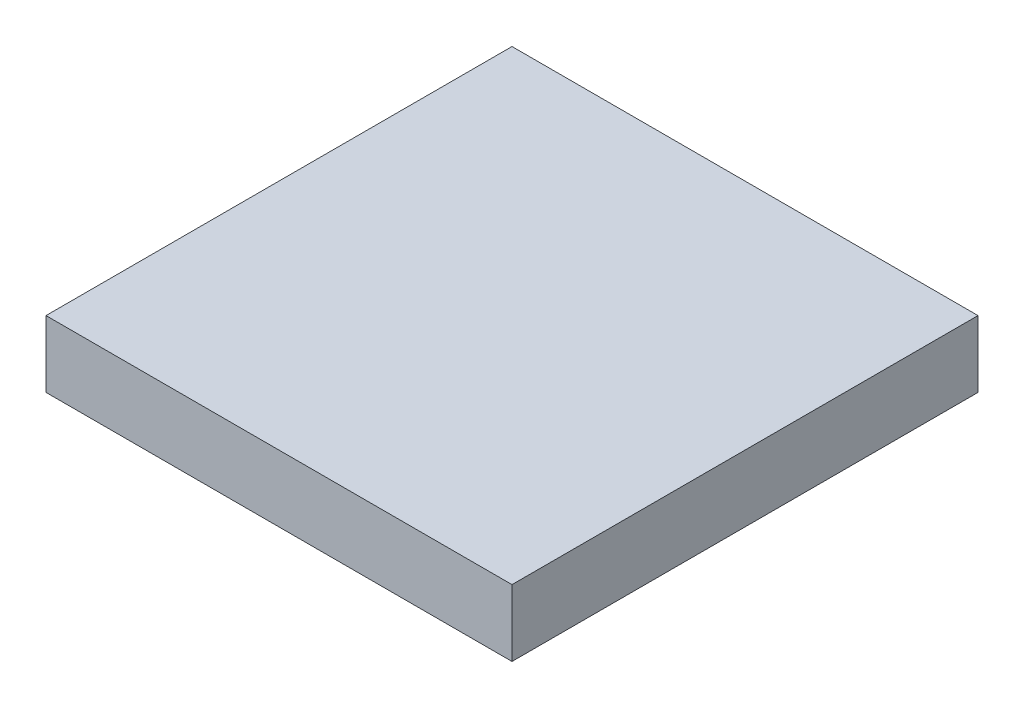
ISO-10303-21;
HEADER;
FILE_DESCRIPTION(('STEP AP214'),'2;1');
FILE_NAME('part.step','',(''),(''),'','','');
FILE_SCHEMA(('AUTOMOTIVE_DESIGN { 1 0 10303 214 1 1 1 1 }'));
ENDSEC;
DATA;
#1=APPLICATION_CONTEXT('core data for automotive mechanical design processes');
#2=APPLICATION_PROTOCOL_DEFINITION('international standard','automotive_design',2000,#1);
#3=PRODUCT_CONTEXT('',#1,'mechanical');
#4=PRODUCT('Part','Part','',(#3));
#5=PRODUCT_RELATED_PRODUCT_CATEGORY('part','',(#4));
#6=PRODUCT_DEFINITION_FORMATION('','',#4);
#7=PRODUCT_DEFINITION_CONTEXT('part definition',#1,'design');
#8=PRODUCT_DEFINITION('design','',#6,#7);
#9=PRODUCT_DEFINITION_SHAPE('','',#8);
#10=(LENGTH_UNIT() NAMED_UNIT(*) SI_UNIT(.MILLI.,.METRE.));
#11=(NAMED_UNIT(*) PLANE_ANGLE_UNIT() SI_UNIT($,.RADIAN.));
#12=(NAMED_UNIT(*) SI_UNIT($,.STERADIAN.) SOLID_ANGLE_UNIT());
#13=UNCERTAINTY_MEASURE_WITH_UNIT(LENGTH_MEASURE(1.E-05),#10,'distance_accuracy_value','');
#14=(GEOMETRIC_REPRESENTATION_CONTEXT(3) GLOBAL_UNCERTAINTY_ASSIGNED_CONTEXT((#13)) GLOBAL_UNIT_ASSIGNED_CONTEXT((#10,
#11,#12)) REPRESENTATION_CONTEXT('',''));
#15=CARTESIAN_POINT('',(0.,0.,0.));
#16=DIRECTION('',(0.,0.,1.));
#17=DIRECTION('',(1.,0.,0.));
#18=AXIS2_PLACEMENT_3D('',#15,#16,#17);
#19=CARTESIAN_POINT('',(-35.,10.,-35.));
#20=DIRECTION('',(1.,0.,0.));
#21=DIRECTION('',(0.,0.,-1.));
#22=AXIS2_PLACEMENT_3D('',#19,#20,#21);
#23=PLANE('',#22);
#24=DIRECTION('',(0.,0.,1.));
#25=VECTOR('',#24,1.);
#26=CARTESIAN_POINT('',(-35.,0.,-35.));
#27=LINE('',#26,#25);
#28=CARTESIAN_POINT('',(-35.,0.,-35.));
#29=VERTEX_POINT('',#28);
#30=CARTESIAN_POINT('',(-35.,0.,35.));
#31=VERTEX_POINT('',#30);
#32=EDGE_CURVE('E97',#29,#31,#27,.T.);
#33=ORIENTED_EDGE('',*,*,#32,.T.);
#34=DIRECTION('',(0.,-1.,0.));
#35=VECTOR('',#34,1.);
#36=CARTESIAN_POINT('',(-35.,10.,35.));
#37=LINE('',#36,#35);
#38=CARTESIAN_POINT('',(-35.,10.,35.));
#39=VERTEX_POINT('',#38);
#40=EDGE_CURVE('E11',#39,#31,#37,.T.);
#41=ORIENTED_EDGE('',*,*,#40,.F.);
#42=DIRECTION('',(0.,0.,1.));
#43=VECTOR('',#42,1.);
#44=CARTESIAN_POINT('',(-35.,10.,-35.));
#45=LINE('',#44,#43);
#46=CARTESIAN_POINT('',(-35.,10.,-35.));
#47=VERTEX_POINT('',#46);
#48=EDGE_CURVE('E85',#47,#39,#45,.T.);
#49=ORIENTED_EDGE('',*,*,#48,.F.);
#50=DIRECTION('',(0.,-1.,0.));
#51=VECTOR('',#50,1.);
#52=CARTESIAN_POINT('',(-35.,10.,-35.));
#53=LINE('',#52,#51);
#54=EDGE_CURVE('E93',#47,#29,#53,.T.);
#55=ORIENTED_EDGE('',*,*,#54,.T.);
#56=EDGE_LOOP('',(#33,#41,#49,#55));
#57=FACE_BOUND('',#56,.T.);
#58=ADVANCED_FACE('F34',(#57),#23,.F.);
#59=CARTESIAN_POINT('',(-35.,10.,35.));
#60=DIRECTION('',(0.,0.,-1.));
#61=DIRECTION('',(-1.,0.,0.));
#62=AXIS2_PLACEMENT_3D('',#59,#60,#61);
#63=PLANE('',#62);
#64=DIRECTION('',(1.,0.,0.));
#65=VECTOR('',#64,1.);
#66=CARTESIAN_POINT('',(-35.,0.,35.));
#67=LINE('',#66,#65);
#68=CARTESIAN_POINT('',(35.,0.,35.));
#69=VERTEX_POINT('',#68);
#70=EDGE_CURVE('E89',#31,#69,#67,.T.);
#71=ORIENTED_EDGE('',*,*,#70,.T.);
#72=DIRECTION('',(0.,-1.,0.));
#73=VECTOR('',#72,1.);
#74=CARTESIAN_POINT('',(35.,10.,35.));
#75=LINE('',#74,#73);
#76=CARTESIAN_POINT('',(35.,10.,35.));
#77=VERTEX_POINT('',#76);
#78=EDGE_CURVE('E42',#77,#69,#75,.T.);
#79=ORIENTED_EDGE('',*,*,#78,.F.);
#80=DIRECTION('',(1.,0.,0.));
#81=VECTOR('',#80,1.);
#82=CARTESIAN_POINT('',(-35.,10.,35.));
#83=LINE('',#82,#81);
#84=EDGE_CURVE('E80',#39,#77,#83,.T.);
#85=ORIENTED_EDGE('',*,*,#84,.F.);
#86=ORIENTED_EDGE('',*,*,#40,.T.);
#87=EDGE_LOOP('',(#71,#79,#85,#86));
#88=FACE_BOUND('',#87,.T.);
#89=ADVANCED_FACE('F88',(#88),#63,.F.);
#90=CARTESIAN_POINT('',(35.,10.,-35.));
#91=DIRECTION('',(-1.,0.,0.));
#92=DIRECTION('',(0.,0.,1.));
#93=AXIS2_PLACEMENT_3D('',#90,#91,#92);
#94=PLANE('',#93);
#95=DIRECTION('',(0.,0.,-1.));
#96=VECTOR('',#95,1.);
#97=CARTESIAN_POINT('',(35.,0.,-35.));
#98=LINE('',#97,#96);
#99=CARTESIAN_POINT('',(35.,0.,-35.));
#100=VERTEX_POINT('',#99);
#101=EDGE_CURVE('E67',#69,#100,#98,.T.);
#102=ORIENTED_EDGE('',*,*,#101,.T.);
#103=DIRECTION('',(0.,-1.,0.));
#104=VECTOR('',#103,1.);
#105=CARTESIAN_POINT('',(35.,10.,-35.));
#106=LINE('',#105,#104);
#107=CARTESIAN_POINT('',(35.,10.,-35.));
#108=VERTEX_POINT('',#107);
#109=EDGE_CURVE('E90',#108,#100,#106,.T.);
#110=ORIENTED_EDGE('',*,*,#109,.F.);
#111=DIRECTION('',(0.,0.,-1.));
#112=VECTOR('',#111,1.);
#113=CARTESIAN_POINT('',(35.,10.,-35.));
#114=LINE('',#113,#112);
#115=EDGE_CURVE('E83',#77,#108,#114,.T.);
#116=ORIENTED_EDGE('',*,*,#115,.F.);
#117=ORIENTED_EDGE('',*,*,#78,.T.);
#118=EDGE_LOOP('',(#102,#110,#116,#117));
#119=FACE_BOUND('',#118,.T.);
#120=ADVANCED_FACE('F91',(#119),#94,.F.);
#121=CARTESIAN_POINT('',(-35.,10.,-35.));
#122=DIRECTION('',(0.,0.,1.));
#123=DIRECTION('',(1.,0.,0.));
#124=AXIS2_PLACEMENT_3D('',#121,#122,#123);
#125=PLANE('',#124);
#126=DIRECTION('',(-1.,0.,0.));
#127=VECTOR('',#126,1.);
#128=CARTESIAN_POINT('',(-35.,0.,-35.));
#129=LINE('',#128,#127);
#130=EDGE_CURVE('E73',#100,#29,#129,.T.);
#131=ORIENTED_EDGE('',*,*,#130,.T.);
#132=ORIENTED_EDGE('',*,*,#54,.F.);
#133=DIRECTION('',(-1.,0.,0.));
#134=VECTOR('',#133,1.);
#135=CARTESIAN_POINT('',(-35.,10.,-35.));
#136=LINE('',#135,#134);
#137=EDGE_CURVE('E50',#108,#47,#136,.T.);
#138=ORIENTED_EDGE('',*,*,#137,.F.);
#139=ORIENTED_EDGE('',*,*,#109,.T.);
#140=EDGE_LOOP('',(#131,#132,#138,#139));
#141=FACE_BOUND('',#140,.T.);
#142=ADVANCED_FACE('F104',(#141),#125,.F.);
#143=CARTESIAN_POINT('',(0.,10.,0.));
#144=DIRECTION('',(0.,1.,0.));
#145=DIRECTION('',(0.,0.,1.));
#146=AXIS2_PLACEMENT_3D('',#143,#144,#145);
#147=PLANE('',#146);
#148=ORIENTED_EDGE('',*,*,#48,.T.);
#149=ORIENTED_EDGE('',*,*,#84,.T.);
#150=ORIENTED_EDGE('',*,*,#115,.T.);
#151=ORIENTED_EDGE('',*,*,#137,.T.);
#152=EDGE_LOOP('',(#148,#149,#150,#151));
#153=FACE_BOUND('',#152,.T.);
#154=ADVANCED_FACE('F81',(#153),#147,.T.);
#155=CARTESIAN_POINT('',(0.,0.,0.));
#156=DIRECTION('',(0.,1.,0.));
#157=DIRECTION('',(0.,0.,1.));
#158=AXIS2_PLACEMENT_3D('',#155,#156,#157);
#159=PLANE('',#158);
#160=ORIENTED_EDGE('',*,*,#32,.F.);
#161=ORIENTED_EDGE('',*,*,#130,.F.);
#162=ORIENTED_EDGE('',*,*,#101,.F.);
#163=ORIENTED_EDGE('',*,*,#70,.F.);
#164=EDGE_LOOP('',(#160,#161,#162,#163));
#165=FACE_BOUND('',#164,.T.);
#166=ADVANCED_FACE('F107',(#165),#159,.F.);
#167=CLOSED_SHELL('',(#58,#89,#120,#142,#154,#166));
#168=MANIFOLD_SOLID_BREP('B2',#167);
#169=ADVANCED_BREP_SHAPE_REPRESENTATION('',(#18,#168),#14);
#170=SHAPE_DEFINITION_REPRESENTATION(#9,#169);
ENDSEC;
END-ISO-10303-21;
